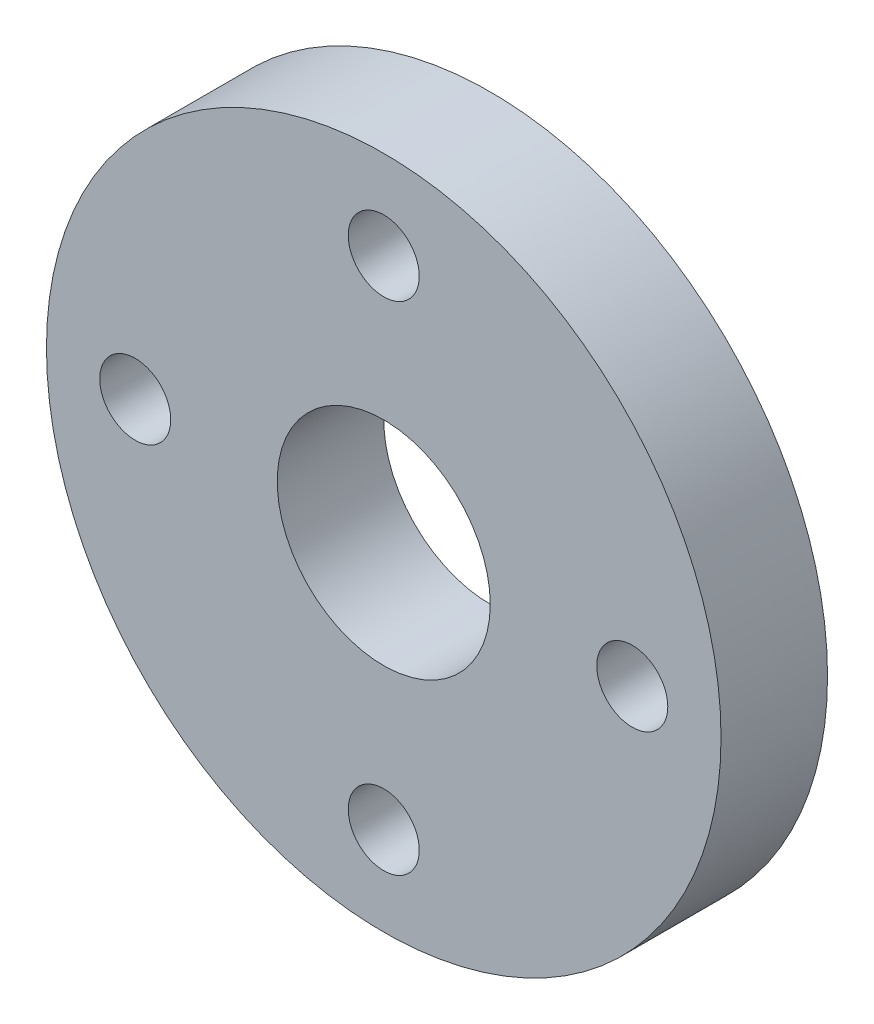
ISO-10303-21;
HEADER;
FILE_DESCRIPTION(('STEP AP214'),'2;1');
FILE_NAME('part.step','',(''),(''),'','','');
FILE_SCHEMA(('AUTOMOTIVE_DESIGN { 1 0 10303 214 1 1 1 1 }'));
ENDSEC;
DATA;
#1=APPLICATION_CONTEXT('core data for automotive mechanical design processes');
#2=APPLICATION_PROTOCOL_DEFINITION('international standard','automotive_design',2000,#1);
#3=PRODUCT_CONTEXT('',#1,'mechanical');
#4=PRODUCT('Part','Part','',(#3));
#5=PRODUCT_RELATED_PRODUCT_CATEGORY('part','',(#4));
#6=PRODUCT_DEFINITION_FORMATION('','',#4);
#7=PRODUCT_DEFINITION_CONTEXT('part definition',#1,'design');
#8=PRODUCT_DEFINITION('design','',#6,#7);
#9=PRODUCT_DEFINITION_SHAPE('','',#8);
#10=(LENGTH_UNIT() NAMED_UNIT(*) SI_UNIT(.MILLI.,.METRE.));
#11=(NAMED_UNIT(*) PLANE_ANGLE_UNIT() SI_UNIT($,.RADIAN.));
#12=(NAMED_UNIT(*) SI_UNIT($,.STERADIAN.) SOLID_ANGLE_UNIT());
#13=UNCERTAINTY_MEASURE_WITH_UNIT(LENGTH_MEASURE(1.E-05),#10,'distance_accuracy_value','');
#14=(GEOMETRIC_REPRESENTATION_CONTEXT(3) GLOBAL_UNCERTAINTY_ASSIGNED_CONTEXT((#13)) GLOBAL_UNIT_ASSIGNED_CONTEXT((#10,
#11,#12)) REPRESENTATION_CONTEXT('',''));
#15=CARTESIAN_POINT('',(0.,0.,0.));
#16=DIRECTION('',(0.,0.,1.));
#17=DIRECTION('',(1.,0.,0.));
#18=AXIS2_PLACEMENT_3D('',#15,#16,#17);
#19=CARTESIAN_POINT('',(0.,0.,3.));
#20=DIRECTION('',(0.,0.,1.));
#21=DIRECTION('',(1.,0.,0.));
#22=AXIS2_PLACEMENT_3D('',#19,#20,#21);
#23=PLANE('',#22);
#24=CARTESIAN_POINT('',(-7.,0.,3.));
#25=DIRECTION('',(0.,0.,1.));
#26=DIRECTION('',(1.,0.,0.));
#27=AXIS2_PLACEMENT_3D('',#24,#25,#26);
#28=CIRCLE('',#27,1.);
#29=CARTESIAN_POINT('',(-6.,0.,3.));
#30=VERTEX_POINT('',#29);
#31=EDGE_CURVE('E58',#30,#30,#28,.T.);
#32=ORIENTED_EDGE('',*,*,#31,.F.);
#33=EDGE_LOOP('',(#32));
#34=FACE_BOUND('',#33,.T.);
#35=CARTESIAN_POINT('',(7.,0.,3.));
#36=DIRECTION('',(0.,0.,1.));
#37=DIRECTION('',(1.,0.,0.));
#38=AXIS2_PLACEMENT_3D('',#35,#36,#37);
#39=CIRCLE('',#38,1.);
#40=CARTESIAN_POINT('',(8.,0.,3.));
#41=VERTEX_POINT('',#40);
#42=EDGE_CURVE('E46',#41,#41,#39,.T.);
#43=ORIENTED_EDGE('',*,*,#42,.F.);
#44=EDGE_LOOP('',(#43));
#45=FACE_BOUND('',#44,.T.);
#46=CARTESIAN_POINT('',(0.,0.,3.));
#47=DIRECTION('',(0.,0.,1.));
#48=DIRECTION('',(1.,0.,0.));
#49=AXIS2_PLACEMENT_3D('',#46,#47,#48);
#50=CIRCLE('',#49,9.5);
#51=CARTESIAN_POINT('',(9.5,0.,3.));
#52=VERTEX_POINT('',#51);
#53=EDGE_CURVE('E10',#52,#52,#50,.T.);
#54=ORIENTED_EDGE('',*,*,#53,.T.);
#55=EDGE_LOOP('',(#54));
#56=FACE_BOUND('',#55,.T.);
#57=CARTESIAN_POINT('',(0.,7.,3.));
#58=DIRECTION('',(0.,0.,1.));
#59=DIRECTION('',(1.,0.,0.));
#60=AXIS2_PLACEMENT_3D('',#57,#58,#59);
#61=CIRCLE('',#60,1.);
#62=CARTESIAN_POINT('',(1.,7.,3.));
#63=VERTEX_POINT('',#62);
#64=EDGE_CURVE('E41',#63,#63,#61,.T.);
#65=ORIENTED_EDGE('',*,*,#64,.F.);
#66=EDGE_LOOP('',(#65));
#67=FACE_BOUND('',#66,.T.);
#68=CARTESIAN_POINT('',(0.,-7.,3.));
#69=DIRECTION('',(0.,0.,1.));
#70=DIRECTION('',(1.,0.,0.));
#71=AXIS2_PLACEMENT_3D('',#68,#69,#70);
#72=CIRCLE('',#71,1.);
#73=CARTESIAN_POINT('',(1.,-7.,3.));
#74=VERTEX_POINT('',#73);
#75=EDGE_CURVE('E52',#74,#74,#72,.T.);
#76=ORIENTED_EDGE('',*,*,#75,.F.);
#77=EDGE_LOOP('',(#76));
#78=FACE_BOUND('',#77,.T.);
#79=CARTESIAN_POINT('',(0.,0.,3.));
#80=DIRECTION('',(0.,0.,1.));
#81=DIRECTION('',(1.,0.,0.));
#82=AXIS2_PLACEMENT_3D('',#79,#80,#81);
#83=CIRCLE('',#82,3.);
#84=CARTESIAN_POINT('',(3.,0.,3.));
#85=VERTEX_POINT('',#84);
#86=EDGE_CURVE('E64',#85,#85,#83,.T.);
#87=ORIENTED_EDGE('',*,*,#86,.F.);
#88=EDGE_LOOP('',(#87));
#89=FACE_BOUND('',#88,.T.);
#90=ADVANCED_FACE('F30',(#34,#45,#56,#67,#78,#89),#23,.T.);
#91=CARTESIAN_POINT('',(0.,0.,0.));
#92=DIRECTION('',(0.,0.,1.));
#93=DIRECTION('',(1.,0.,0.));
#94=AXIS2_PLACEMENT_3D('',#91,#92,#93);
#95=PLANE('',#94);
#96=CARTESIAN_POINT('',(0.,0.,0.));
#97=DIRECTION('',(0.,0.,1.));
#98=DIRECTION('',(1.,0.,0.));
#99=AXIS2_PLACEMENT_3D('',#96,#97,#98);
#100=CIRCLE('',#99,9.5);
#101=CARTESIAN_POINT('',(9.5,0.,0.));
#102=VERTEX_POINT('',#101);
#103=EDGE_CURVE('E34',#102,#102,#100,.T.);
#104=ORIENTED_EDGE('',*,*,#103,.F.);
#105=EDGE_LOOP('',(#104));
#106=FACE_BOUND('',#105,.T.);
#107=CARTESIAN_POINT('',(0.,7.,0.));
#108=DIRECTION('',(0.,0.,1.));
#109=DIRECTION('',(1.,0.,0.));
#110=AXIS2_PLACEMENT_3D('',#107,#108,#109);
#111=CIRCLE('',#110,1.);
#112=CARTESIAN_POINT('',(1.,7.,0.));
#113=VERTEX_POINT('',#112);
#114=EDGE_CURVE('E43',#113,#113,#111,.T.);
#115=ORIENTED_EDGE('',*,*,#114,.T.);
#116=EDGE_LOOP('',(#115));
#117=FACE_BOUND('',#116,.T.);
#118=CARTESIAN_POINT('',(7.,0.,0.));
#119=DIRECTION('',(0.,0.,1.));
#120=DIRECTION('',(1.,0.,0.));
#121=AXIS2_PLACEMENT_3D('',#118,#119,#120);
#122=CIRCLE('',#121,1.);
#123=CARTESIAN_POINT('',(8.,0.,0.));
#124=VERTEX_POINT('',#123);
#125=EDGE_CURVE('E49',#124,#124,#122,.T.);
#126=ORIENTED_EDGE('',*,*,#125,.T.);
#127=EDGE_LOOP('',(#126));
#128=FACE_BOUND('',#127,.T.);
#129=CARTESIAN_POINT('',(0.,-7.,0.));
#130=DIRECTION('',(0.,0.,1.));
#131=DIRECTION('',(1.,0.,0.));
#132=AXIS2_PLACEMENT_3D('',#129,#130,#131);
#133=CIRCLE('',#132,1.);
#134=CARTESIAN_POINT('',(1.,-7.,0.));
#135=VERTEX_POINT('',#134);
#136=EDGE_CURVE('E55',#135,#135,#133,.T.);
#137=ORIENTED_EDGE('',*,*,#136,.T.);
#138=EDGE_LOOP('',(#137));
#139=FACE_BOUND('',#138,.T.);
#140=CARTESIAN_POINT('',(-7.,0.,0.));
#141=DIRECTION('',(0.,0.,1.));
#142=DIRECTION('',(1.,0.,0.));
#143=AXIS2_PLACEMENT_3D('',#140,#141,#142);
#144=CIRCLE('',#143,1.);
#145=CARTESIAN_POINT('',(-6.,0.,0.));
#146=VERTEX_POINT('',#145);
#147=EDGE_CURVE('E61',#146,#146,#144,.T.);
#148=ORIENTED_EDGE('',*,*,#147,.T.);
#149=EDGE_LOOP('',(#148));
#150=FACE_BOUND('',#149,.T.);
#151=CARTESIAN_POINT('',(0.,0.,0.));
#152=DIRECTION('',(0.,0.,1.));
#153=DIRECTION('',(1.,0.,0.));
#154=AXIS2_PLACEMENT_3D('',#151,#152,#153);
#155=CIRCLE('',#154,3.);
#156=CARTESIAN_POINT('',(3.,0.,0.));
#157=VERTEX_POINT('',#156);
#158=EDGE_CURVE('E67',#157,#157,#155,.T.);
#159=ORIENTED_EDGE('',*,*,#158,.T.);
#160=EDGE_LOOP('',(#159));
#161=FACE_BOUND('',#160,.T.);
#162=ADVANCED_FACE('F77',(#106,#117,#128,#139,#150,#161),#95,.F.);
#163=CARTESIAN_POINT('',(0.,0.,3.));
#164=DIRECTION('',(0.,0.,-1.));
#165=DIRECTION('',(-1.,0.,0.));
#166=AXIS2_PLACEMENT_3D('',#163,#164,#165);
#167=CYLINDRICAL_SURFACE('',#166,9.5);
#168=ORIENTED_EDGE('',*,*,#53,.F.);
#169=EDGE_LOOP('',(#168));
#170=FACE_BOUND('',#169,.T.);
#171=ORIENTED_EDGE('',*,*,#103,.T.);
#172=EDGE_LOOP('',(#171));
#173=FACE_BOUND('',#172,.T.);
#174=ADVANCED_FACE('F32',(#170,#173),#167,.T.);
#175=CARTESIAN_POINT('',(0.,7.,3.));
#176=DIRECTION('',(0.,0.,-1.));
#177=DIRECTION('',(-1.,0.,0.));
#178=AXIS2_PLACEMENT_3D('',#175,#176,#177);
#179=CYLINDRICAL_SURFACE('',#178,1.);
#180=ORIENTED_EDGE('',*,*,#64,.T.);
#181=EDGE_LOOP('',(#180));
#182=FACE_BOUND('',#181,.T.);
#183=ORIENTED_EDGE('',*,*,#114,.F.);
#184=EDGE_LOOP('',(#183));
#185=FACE_BOUND('',#184,.T.);
#186=ADVANCED_FACE('F87',(#182,#185),#179,.F.);
#187=CARTESIAN_POINT('',(7.,0.,3.));
#188=DIRECTION('',(0.,0.,-1.));
#189=DIRECTION('',(-1.,0.,0.));
#190=AXIS2_PLACEMENT_3D('',#187,#188,#189);
#191=CYLINDRICAL_SURFACE('',#190,1.);
#192=ORIENTED_EDGE('',*,*,#42,.T.);
#193=EDGE_LOOP('',(#192));
#194=FACE_BOUND('',#193,.T.);
#195=ORIENTED_EDGE('',*,*,#125,.F.);
#196=EDGE_LOOP('',(#195));
#197=FACE_BOUND('',#196,.T.);
#198=ADVANCED_FACE('F90',(#194,#197),#191,.F.);
#199=CARTESIAN_POINT('',(0.,-7.,3.));
#200=DIRECTION('',(0.,0.,-1.));
#201=DIRECTION('',(-1.,0.,0.));
#202=AXIS2_PLACEMENT_3D('',#199,#200,#201);
#203=CYLINDRICAL_SURFACE('',#202,1.);
#204=ORIENTED_EDGE('',*,*,#75,.T.);
#205=EDGE_LOOP('',(#204));
#206=FACE_BOUND('',#205,.T.);
#207=ORIENTED_EDGE('',*,*,#136,.F.);
#208=EDGE_LOOP('',(#207));
#209=FACE_BOUND('',#208,.T.);
#210=ADVANCED_FACE('F94',(#206,#209),#203,.F.);
#211=CARTESIAN_POINT('',(-7.,0.,3.));
#212=DIRECTION('',(0.,0.,-1.));
#213=DIRECTION('',(-1.,0.,0.));
#214=AXIS2_PLACEMENT_3D('',#211,#212,#213);
#215=CYLINDRICAL_SURFACE('',#214,1.);
#216=ORIENTED_EDGE('',*,*,#31,.T.);
#217=EDGE_LOOP('',(#216));
#218=FACE_BOUND('',#217,.T.);
#219=ORIENTED_EDGE('',*,*,#147,.F.);
#220=EDGE_LOOP('',(#219));
#221=FACE_BOUND('',#220,.T.);
#222=ADVANCED_FACE('F98',(#218,#221),#215,.F.);
#223=CARTESIAN_POINT('',(0.,0.,3.));
#224=DIRECTION('',(0.,0.,-1.));
#225=DIRECTION('',(-1.,0.,0.));
#226=AXIS2_PLACEMENT_3D('',#223,#224,#225);
#227=CYLINDRICAL_SURFACE('',#226,3.);
#228=ORIENTED_EDGE('',*,*,#86,.T.);
#229=EDGE_LOOP('',(#228));
#230=FACE_BOUND('',#229,.T.);
#231=ORIENTED_EDGE('',*,*,#158,.F.);
#232=EDGE_LOOP('',(#231));
#233=FACE_BOUND('',#232,.T.);
#234=ADVANCED_FACE('F73',(#230,#233),#227,.F.);
#235=CLOSED_SHELL('',(#90,#162,#174,#186,#198,#210,#222,#234));
#236=MANIFOLD_SOLID_BREP('B2',#235);
#237=ADVANCED_BREP_SHAPE_REPRESENTATION('',(#18,#236),#14);
#238=SHAPE_DEFINITION_REPRESENTATION(#9,#237);
ENDSEC;
END-ISO-10303-21;
